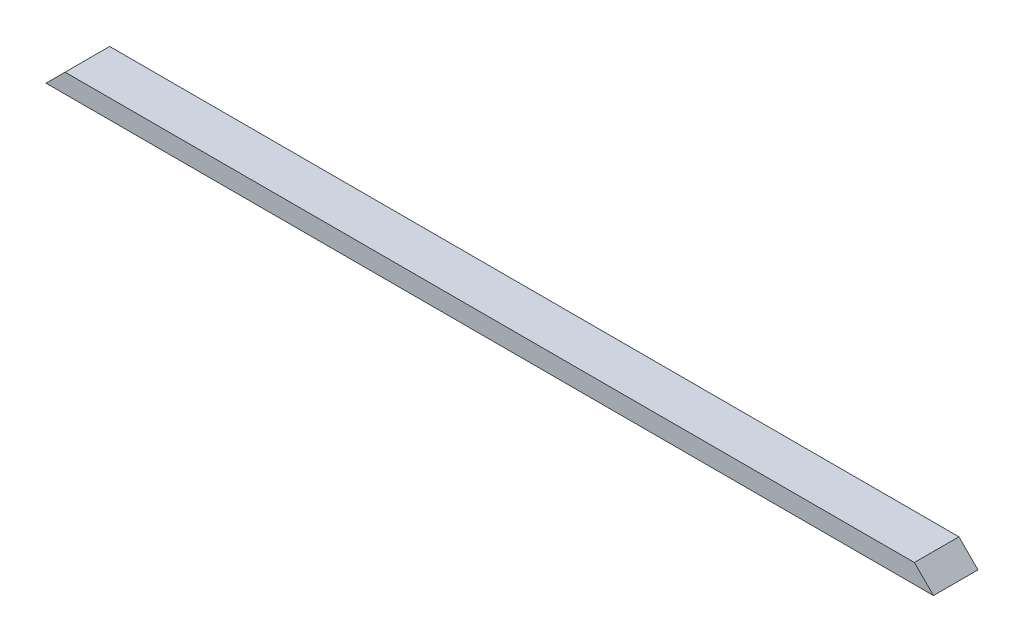
ISO-10303-21;
HEADER;
FILE_DESCRIPTION(('STEP AP214'),'2;1');
FILE_NAME('part.step','',(''),(''),'','','');
FILE_SCHEMA(('AUTOMOTIVE_DESIGN { 1 0 10303 214 1 1 1 1 }'));
ENDSEC;
DATA;
#1=APPLICATION_CONTEXT('core data for automotive mechanical design processes');
#2=APPLICATION_PROTOCOL_DEFINITION('international standard','automotive_design',2000,#1);
#3=PRODUCT_CONTEXT('',#1,'mechanical');
#4=PRODUCT('Part','Part','',(#3));
#5=PRODUCT_RELATED_PRODUCT_CATEGORY('part','',(#4));
#6=PRODUCT_DEFINITION_FORMATION('','',#4);
#7=PRODUCT_DEFINITION_CONTEXT('part definition',#1,'design');
#8=PRODUCT_DEFINITION('design','',#6,#7);
#9=PRODUCT_DEFINITION_SHAPE('','',#8);
#10=(LENGTH_UNIT() NAMED_UNIT(*) SI_UNIT(.MILLI.,.METRE.));
#11=(NAMED_UNIT(*) PLANE_ANGLE_UNIT() SI_UNIT($,.RADIAN.));
#12=(NAMED_UNIT(*) SI_UNIT($,.STERADIAN.) SOLID_ANGLE_UNIT());
#13=UNCERTAINTY_MEASURE_WITH_UNIT(LENGTH_MEASURE(1.E-05),#10,'distance_accuracy_value','');
#14=(GEOMETRIC_REPRESENTATION_CONTEXT(3) GLOBAL_UNCERTAINTY_ASSIGNED_CONTEXT((#13)) GLOBAL_UNIT_ASSIGNED_CONTEXT((#10,
#11,#12)) REPRESENTATION_CONTEXT('',''));
#15=CARTESIAN_POINT('',(0.,0.,0.));
#16=DIRECTION('',(0.,0.,1.));
#17=DIRECTION('',(1.,0.,0.));
#18=AXIS2_PLACEMENT_3D('',#15,#16,#17);
#19=CARTESIAN_POINT('',(0.,38.1,0.));
#20=DIRECTION('',(0.,0.,-1.));
#21=DIRECTION('',(-1.,0.,0.));
#22=AXIS2_PLACEMENT_3D('',#19,#20,#21);
#23=PLANE('',#22);
#24=DIRECTION('',(1.,0.,0.));
#25=VECTOR('',#24,1.);
#26=CARTESIAN_POINT('',(0.,38.1,0.));
#27=LINE('',#26,#25);
#28=CARTESIAN_POINT('',(38.1,38.1,0.));
#29=VERTEX_POINT('',#28);
#30=CARTESIAN_POINT('',(1733.55,38.1000000000001,0.));
#31=VERTEX_POINT('',#30);
#32=EDGE_CURVE('E50',#29,#31,#27,.T.);
#33=ORIENTED_EDGE('',*,*,#32,.F.);
#34=DIRECTION('',(0.707106781186547,0.707106781186547,0.));
#35=VECTOR('',#34,1.);
#36=CARTESIAN_POINT('',(0.,0.,0.));
#37=LINE('',#36,#35);
#38=CARTESIAN_POINT('',(0.,0.,0.));
#39=VERTEX_POINT('',#38);
#40=EDGE_CURVE('E85',#39,#29,#37,.T.);
#41=ORIENTED_EDGE('',*,*,#40,.F.);
#42=DIRECTION('',(1.,0.,0.));
#43=VECTOR('',#42,1.);
#44=CARTESIAN_POINT('',(0.,0.,0.));
#45=LINE('',#44,#43);
#46=CARTESIAN_POINT('',(1771.65,0.,0.));
#47=VERTEX_POINT('',#46);
#48=EDGE_CURVE('E91',#39,#47,#45,.T.);
#49=ORIENTED_EDGE('',*,*,#48,.T.);
#50=DIRECTION('',(0.707106781186547,-0.707106781186548,0.));
#51=VECTOR('',#50,1.);
#52=CARTESIAN_POINT('',(1733.55,38.1000000000001,0.));
#53=LINE('',#52,#51);
#54=EDGE_CURVE('E66',#31,#47,#53,.T.);
#55=ORIENTED_EDGE('',*,*,#54,.F.);
#56=EDGE_LOOP('',(#33,#41,#49,#55));
#57=FACE_BOUND('',#56,.T.);
#58=ADVANCED_FACE('F41',(#57),#23,.F.);
#59=CARTESIAN_POINT('',(0.,38.1,-88.9));
#60=DIRECTION('',(0.,0.,1.));
#61=DIRECTION('',(1.,0.,0.));
#62=AXIS2_PLACEMENT_3D('',#59,#60,#61);
#63=PLANE('',#62);
#64=DIRECTION('',(-1.,0.,0.));
#65=VECTOR('',#64,1.);
#66=CARTESIAN_POINT('',(0.,0.,-88.9));
#67=LINE('',#66,#65);
#68=CARTESIAN_POINT('',(1771.65,0.,-88.9));
#69=VERTEX_POINT('',#68);
#70=CARTESIAN_POINT('',(0.,0.,-88.9));
#71=VERTEX_POINT('',#70);
#72=EDGE_CURVE('E44',#69,#71,#67,.T.);
#73=ORIENTED_EDGE('',*,*,#72,.T.);
#74=DIRECTION('',(0.707106781186547,0.707106781186547,0.));
#75=VECTOR('',#74,1.);
#76=CARTESIAN_POINT('',(0.,0.,-88.9));
#77=LINE('',#76,#75);
#78=CARTESIAN_POINT('',(38.1,38.1,-88.9));
#79=VERTEX_POINT('',#78);
#80=EDGE_CURVE('E58',#71,#79,#77,.T.);
#81=ORIENTED_EDGE('',*,*,#80,.T.);
#82=DIRECTION('',(-1.,0.,0.));
#83=VECTOR('',#82,1.);
#84=CARTESIAN_POINT('',(0.,38.1,-88.9));
#85=LINE('',#84,#83);
#86=CARTESIAN_POINT('',(1733.55,38.1000000000001,-88.9));
#87=VERTEX_POINT('',#86);
#88=EDGE_CURVE('E11',#87,#79,#85,.T.);
#89=ORIENTED_EDGE('',*,*,#88,.F.);
#90=DIRECTION('',(0.707106781186547,-0.707106781186548,0.));
#91=VECTOR('',#90,1.);
#92=CARTESIAN_POINT('',(1733.55,38.1000000000001,-88.9));
#93=LINE('',#92,#91);
#94=EDGE_CURVE('E109',#87,#69,#93,.T.);
#95=ORIENTED_EDGE('',*,*,#94,.T.);
#96=EDGE_LOOP('',(#73,#81,#89,#95));
#97=FACE_BOUND('',#96,.T.);
#98=ADVANCED_FACE('F124',(#97),#63,.F.);
#99=CARTESIAN_POINT('',(0.,38.1,0.));
#100=DIRECTION('',(0.,-1.,0.));
#101=DIRECTION('',(0.,0.,-1.));
#102=AXIS2_PLACEMENT_3D('',#99,#100,#101);
#103=PLANE('',#102);
#104=ORIENTED_EDGE('',*,*,#88,.T.);
#105=DIRECTION('',(0.,0.,1.));
#106=VECTOR('',#105,1.);
#107=CARTESIAN_POINT('',(38.1,38.1,-88.9));
#108=LINE('',#107,#106);
#109=EDGE_CURVE('E92',#79,#29,#108,.T.);
#110=ORIENTED_EDGE('',*,*,#109,.T.);
#111=ORIENTED_EDGE('',*,*,#32,.T.);
#112=DIRECTION('',(0.,0.,1.));
#113=VECTOR('',#112,1.);
#114=CARTESIAN_POINT('',(1733.55,38.1000000000001,-88.9));
#115=LINE('',#114,#113);
#116=EDGE_CURVE('E113',#87,#31,#115,.T.);
#117=ORIENTED_EDGE('',*,*,#116,.F.);
#118=EDGE_LOOP('',(#104,#110,#111,#117));
#119=FACE_BOUND('',#118,.T.);
#120=ADVANCED_FACE('F127',(#119),#103,.F.);
#121=CARTESIAN_POINT('',(0.,0.,0.));
#122=DIRECTION('',(0.,-1.,0.));
#123=DIRECTION('',(0.,0.,-1.));
#124=AXIS2_PLACEMENT_3D('',#121,#122,#123);
#125=PLANE('',#124);
#126=DIRECTION('',(0.,0.,1.));
#127=VECTOR('',#126,1.);
#128=CARTESIAN_POINT('',(0.,0.,0.));
#129=LINE('',#128,#127);
#130=EDGE_CURVE('E82',#71,#39,#129,.T.);
#131=ORIENTED_EDGE('',*,*,#130,.F.);
#132=ORIENTED_EDGE('',*,*,#72,.F.);
#133=DIRECTION('',(0.,0.,-1.));
#134=VECTOR('',#133,1.);
#135=CARTESIAN_POINT('',(1771.65,0.,0.));
#136=LINE('',#135,#134);
#137=EDGE_CURVE('E101',#47,#69,#136,.T.);
#138=ORIENTED_EDGE('',*,*,#137,.F.);
#139=ORIENTED_EDGE('',*,*,#48,.F.);
#140=EDGE_LOOP('',(#131,#132,#138,#139));
#141=FACE_BOUND('',#140,.T.);
#142=ADVANCED_FACE('F100',(#141),#125,.T.);
#143=CARTESIAN_POINT('',(1733.55,38.1000000000001,-88.9));
#144=DIRECTION('',(-0.707106781186548,-0.707106781186547,0.));
#145=DIRECTION('',(0.707106781186547,-0.707106781186548,0.));
#146=AXIS2_PLACEMENT_3D('',#143,#144,#145);
#147=PLANE('',#146);
#148=ORIENTED_EDGE('',*,*,#54,.T.);
#149=ORIENTED_EDGE('',*,*,#137,.T.);
#150=ORIENTED_EDGE('',*,*,#94,.F.);
#151=ORIENTED_EDGE('',*,*,#116,.T.);
#152=EDGE_LOOP('',(#148,#149,#150,#151));
#153=FACE_BOUND('',#152,.T.);
#154=ADVANCED_FACE('F128',(#153),#147,.F.);
#155=CARTESIAN_POINT('',(0.,0.,-88.9));
#156=DIRECTION('',(0.707106781186547,-0.707106781186547,0.));
#157=DIRECTION('',(0.707106781186548,0.707106781186548,0.));
#158=AXIS2_PLACEMENT_3D('',#155,#156,#157);
#159=PLANE('',#158);
#160=ORIENTED_EDGE('',*,*,#40,.T.);
#161=ORIENTED_EDGE('',*,*,#109,.F.);
#162=ORIENTED_EDGE('',*,*,#80,.F.);
#163=ORIENTED_EDGE('',*,*,#130,.T.);
#164=EDGE_LOOP('',(#160,#161,#162,#163));
#165=FACE_BOUND('',#164,.T.);
#166=ADVANCED_FACE('F84',(#165),#159,.F.);
#167=CLOSED_SHELL('',(#58,#98,#120,#142,#154,#166));
#168=MANIFOLD_SOLID_BREP('B2',#167);
#169=ADVANCED_BREP_SHAPE_REPRESENTATION('',(#18,#168),#14);
#170=SHAPE_DEFINITION_REPRESENTATION(#9,#169);
ENDSEC;
END-ISO-10303-21;
